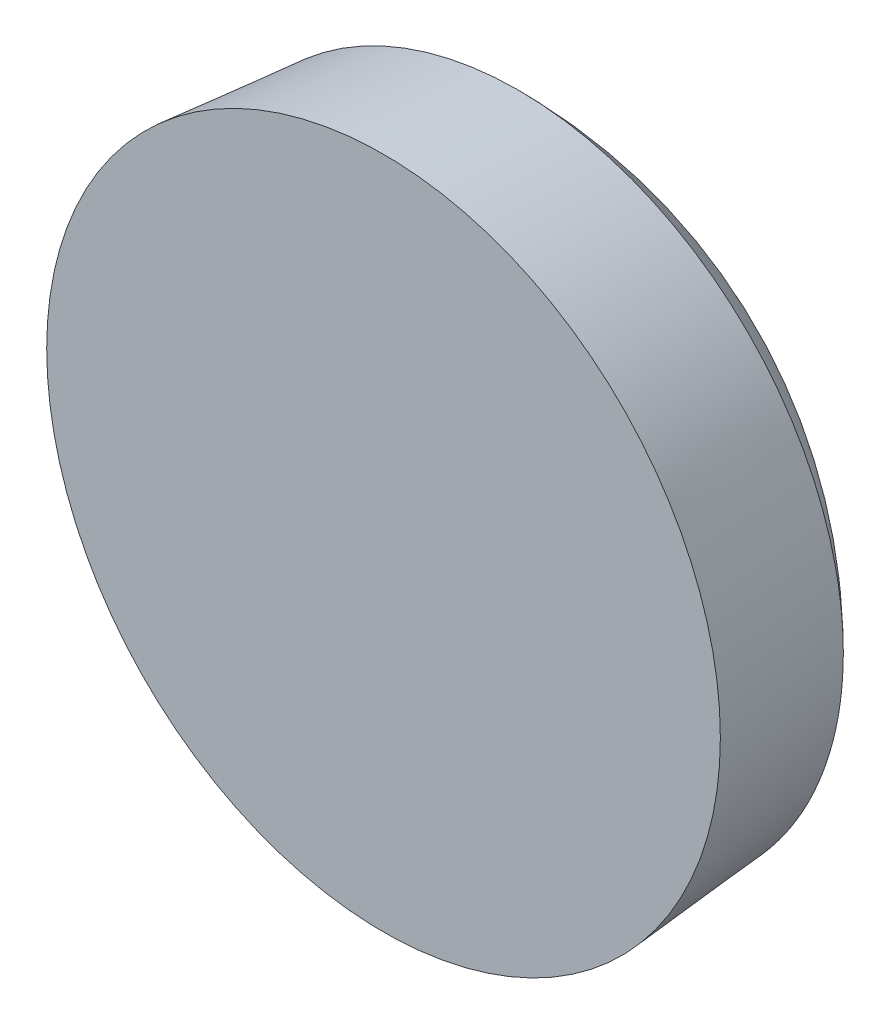
ISO-10303-21;
HEADER;
FILE_DESCRIPTION(('STEP AP214'),'2;1');
FILE_NAME('part.step','',(''),(''),'','','');
FILE_SCHEMA(('AUTOMOTIVE_DESIGN { 1 0 10303 214 1 1 1 1 }'));
ENDSEC;
DATA;
#1=APPLICATION_CONTEXT('core data for automotive mechanical design processes');
#2=APPLICATION_PROTOCOL_DEFINITION('international standard','automotive_design',2000,#1);
#3=PRODUCT_CONTEXT('',#1,'mechanical');
#4=PRODUCT('Part','Part','',(#3));
#5=PRODUCT_RELATED_PRODUCT_CATEGORY('part','',(#4));
#6=PRODUCT_DEFINITION_FORMATION('','',#4);
#7=PRODUCT_DEFINITION_CONTEXT('part definition',#1,'design');
#8=PRODUCT_DEFINITION('design','',#6,#7);
#9=PRODUCT_DEFINITION_SHAPE('','',#8);
#10=(LENGTH_UNIT() NAMED_UNIT(*) SI_UNIT(.MILLI.,.METRE.));
#11=(NAMED_UNIT(*) PLANE_ANGLE_UNIT() SI_UNIT($,.RADIAN.));
#12=(NAMED_UNIT(*) SI_UNIT($,.STERADIAN.) SOLID_ANGLE_UNIT());
#13=UNCERTAINTY_MEASURE_WITH_UNIT(LENGTH_MEASURE(1.E-05),#10,'distance_accuracy_value','');
#14=(GEOMETRIC_REPRESENTATION_CONTEXT(3) GLOBAL_UNCERTAINTY_ASSIGNED_CONTEXT((#13)) GLOBAL_UNIT_ASSIGNED_CONTEXT((#10,
#11,#12)) REPRESENTATION_CONTEXT('',''));
#15=CARTESIAN_POINT('',(0.,0.,0.));
#16=DIRECTION('',(0.,0.,1.));
#17=DIRECTION('',(1.,0.,0.));
#18=AXIS2_PLACEMENT_3D('',#15,#16,#17);
#19=CARTESIAN_POINT('',(6.90000000000015,4.50499199787339,-21.6));
#20=DIRECTION('',(0.,0.,-1.));
#21=DIRECTION('',(0.,1.,0.));
#22=AXIS2_PLACEMENT_3D('',#19,#20,#21);
#23=PLANE('',#22);
#24=DIRECTION('',(0.747876143588401,-0.66383828893138,0.));
#25=VECTOR('',#24,1.);
#26=CARTESIAN_POINT('',(7.0194908920078,4.6396097037193,-21.6));
#27=LINE('',#26,#25);
#28=CARTESIAN_POINT('',(6.88487318616189,4.75910059572695,-21.6));
#29=VERTEX_POINT('',#28);
#30=CARTESIAN_POINT('',(6.30900855559882,5.27025607820411,-21.6));
#31=VERTEX_POINT('',#30);
#32=EDGE_CURVE('E84',#29,#31,#27,.F.);
#33=ORIENTED_EDGE('',*,*,#32,.F.);
#34=DIRECTION('',(0.66383828893138,0.747876143588401,0.));
#35=VECTOR('',#34,1.);
#36=CARTESIAN_POINT('',(6.76538229415424,4.62448288988104,-21.6));
#37=LINE('',#36,#35);
#38=CARTESIAN_POINT('',(7.39602866863905,5.33496522629002,-21.6));
#39=VERTEX_POINT('',#38);
#40=EDGE_CURVE('E89',#39,#29,#37,.F.);
#41=ORIENTED_EDGE('',*,*,#40,.F.);
#42=DIRECTION('',(0.747876143588401,-0.66383828893138,0.));
#43=VECTOR('',#42,1.);
#44=CARTESIAN_POINT('',(7.53064637448496,5.21547433428237,-21.6));
#45=LINE('',#44,#43);
#46=CARTESIAN_POINT('',(7.66526408033087,5.09598344227472,-21.6));
#47=VERTEX_POINT('',#46);
#48=EDGE_CURVE('E140',#47,#39,#45,.F.);
#49=ORIENTED_EDGE('',*,*,#48,.F.);
#50=DIRECTION('',(-0.66383828893138,-0.747876143588401,0.));
#51=VECTOR('',#50,1.);
#52=CARTESIAN_POINT('',(7.03461770584606,4.38550110586574,-21.6));
#53=LINE('',#52,#51);
#54=CARTESIAN_POINT('',(7.15410859785371,4.52011881171165,-21.6));
#55=VERTEX_POINT('',#54);
#56=EDGE_CURVE('E151',#55,#47,#53,.F.);
#57=ORIENTED_EDGE('',*,*,#56,.F.);
#58=DIRECTION('',(0.747876143588401,-0.66383828893138,0.));
#59=VECTOR('',#58,1.);
#60=CARTESIAN_POINT('',(7.0194908920078,4.6396097037193,-21.6));
#61=LINE('',#60,#59);
#62=CARTESIAN_POINT('',(7.72997322841678,4.0089633292345,-21.6));
#63=VERTEX_POINT('',#62);
#64=EDGE_CURVE('E154',#63,#55,#61,.F.);
#65=ORIENTED_EDGE('',*,*,#64,.F.);
#66=DIRECTION('',(-0.66383828893138,-0.747876143588401,0.));
#67=VECTOR('',#66,1.);
#68=CARTESIAN_POINT('',(7.61048233640913,3.87434562338858,-21.6));
#69=LINE('',#68,#67);
#70=CARTESIAN_POINT('',(7.49099144440148,3.73972791754266,-21.6));
#71=VERTEX_POINT('',#70);
#72=EDGE_CURVE('E162',#71,#63,#69,.F.);
#73=ORIENTED_EDGE('',*,*,#72,.F.);
#74=DIRECTION('',(-0.747876143588401,0.66383828893138,0.));
#75=VECTOR('',#74,1.);
#76=CARTESIAN_POINT('',(6.7805091079925,4.37037429202747,-21.6));
#77=LINE('',#76,#75);
#78=CARTESIAN_POINT('',(6.91512681383842,4.25088340001982,-21.6));
#79=VERTEX_POINT('',#78);
#80=EDGE_CURVE('E167',#79,#71,#77,.F.);
#81=ORIENTED_EDGE('',*,*,#80,.F.);
#82=DIRECTION('',(-0.66383828893138,-0.747876143588401,0.));
#83=VECTOR('',#82,1.);
#84=CARTESIAN_POINT('',(7.03461770584606,4.38550110586574,-21.6));
#85=LINE('',#84,#83);
#86=CARTESIAN_POINT('',(6.40397133136125,3.67501876945676,-21.6));
#87=VERTEX_POINT('',#86);
#88=EDGE_CURVE('E172',#87,#79,#85,.F.);
#89=ORIENTED_EDGE('',*,*,#88,.F.);
#90=DIRECTION('',(0.747876143588401,-0.66383828893138,0.));
#91=VECTOR('',#90,1.);
#92=CARTESIAN_POINT('',(6.26935362551534,3.79450966146441,-21.6));
#93=LINE('',#92,#91);
#94=CARTESIAN_POINT('',(6.13473591966943,3.91400055347206,-21.6));
#95=VERTEX_POINT('',#94);
#96=EDGE_CURVE('E178',#87,#95,#93,.F.);
#97=ORIENTED_EDGE('',*,*,#96,.T.);
#98=DIRECTION('',(0.66383828893138,0.747876143588401,0.));
#99=VECTOR('',#98,1.);
#100=CARTESIAN_POINT('',(6.76538229415424,4.62448288988104,-21.6));
#101=LINE('',#100,#99);
#102=CARTESIAN_POINT('',(6.64589140214659,4.48986518403512,-21.6));
#103=VERTEX_POINT('',#102);
#104=EDGE_CURVE('E183',#103,#95,#101,.F.);
#105=ORIENTED_EDGE('',*,*,#104,.F.);
#106=DIRECTION('',(-0.747876143588401,0.66383828893138,0.));
#107=VECTOR('',#106,1.);
#108=CARTESIAN_POINT('',(6.7805091079925,4.37037429202747,-21.6));
#109=LINE('',#108,#107);
#110=CARTESIAN_POINT('',(6.07002677158352,5.00102066651228,-21.6));
#111=VERTEX_POINT('',#110);
#112=EDGE_CURVE('E119',#111,#103,#109,.F.);
#113=ORIENTED_EDGE('',*,*,#112,.F.);
#114=DIRECTION('',(-0.66383828893138,-0.747876143588401,0.));
#115=VECTOR('',#114,1.);
#116=CARTESIAN_POINT('',(6.18951766359117,5.1356383723582,-21.6));
#117=LINE('',#116,#115);
#118=EDGE_CURVE('E117',#111,#31,#117,.F.);
#119=ORIENTED_EDGE('',*,*,#118,.T.);
#120=EDGE_LOOP('',(#33,#41,#49,#57,#65,#73,#81,#89,#97,#105,#113,#119));
#121=FACE_BOUND('',#120,.T.);
#122=ADVANCED_FACE('F17',(#121),#23,.T.);
#123=CARTESIAN_POINT('',(7.0194908920078,4.6396097037193,-22.2));
#124=DIRECTION('',(-0.66383828893138,-0.747876143588401,0.));
#125=DIRECTION('',(0.747876143588401,-0.66383828893138,0.));
#126=AXIS2_PLACEMENT_3D('',#123,#124,#125);
#127=PLANE('',#126);
#128=DIRECTION('',(0.,0.,1.));
#129=VECTOR('',#128,1.);
#130=CARTESIAN_POINT('',(6.88487318616189,4.75910059572695,-22.2));
#131=LINE('',#130,#129);
#132=CARTESIAN_POINT('',(6.88487318616188,4.75910059572695,-22.788097569794));
#133=VERTEX_POINT('',#132);
#134=EDGE_CURVE('E127',#29,#133,#131,.F.);
#135=ORIENTED_EDGE('',*,*,#134,.F.);
#136=ORIENTED_EDGE('',*,*,#32,.T.);
#137=DIRECTION('',(0.,0.,1.));
#138=VECTOR('',#137,1.);
#139=CARTESIAN_POINT('',(6.30900855559882,5.27025607820411,-22.2));
#140=LINE('',#139,#138);
#141=CARTESIAN_POINT('',(6.30900855559882,5.27025607820411,-22.6229045231911));
#142=VERTEX_POINT('',#141);
#143=EDGE_CURVE('E123',#31,#142,#140,.F.);
#144=ORIENTED_EDGE('',*,*,#143,.T.);
#145=CARTESIAN_POINT('',(6.88487318616188,4.75910059572695,-22.788097569794));
#146=CARTESIAN_POINT('',(6.86018725238199,4.78101260372668,-22.7859104299673));
#147=CARTESIAN_POINT('',(6.83553118762501,4.80289809904617,-22.7831210421487));
#148=CARTESIAN_POINT('',(6.78640820570417,4.84650119635726,-22.7763560552392));
#149=CARTESIAN_POINT('',(6.76194092600565,4.868219120146,-22.7723851623111));
#150=CARTESIAN_POINT('',(6.71319426733734,4.91148818115152,-22.7632701136372));
#151=CARTESIAN_POINT('',(6.68891456403111,4.93303960625947,-22.7581290588921));
#152=CARTESIAN_POINT('',(6.64054218782471,4.97597644242906,-22.7466823115268));
#153=CARTESIAN_POINT('',(6.61644931068595,4.99736203477927,-22.7403781619621));
#154=CARTESIAN_POINT('',(6.56844981562365,5.03996788996653,-22.7266089835755));
#155=CARTESIAN_POINT('',(6.54454319770011,5.06118815280357,-22.7191439547536));
#156=CARTESIAN_POINT('',(6.4969160965814,5.10346345946291,-22.703052205587));
#157=CARTESIAN_POINT('',(6.47319590048996,5.12451824844295,-22.6944239659575));
#158=CARTESIAN_POINT('',(6.42594275839351,5.16646161736154,-22.6760004253173));
#159=CARTESIAN_POINT('',(6.40241046789994,5.1873496154476,-22.666202118307));
#160=CARTESIAN_POINT('',(6.35553505693748,5.22895769838091,-22.6454289197685));
#161=CARTESIAN_POINT('',(6.33219304956501,5.24967679520893,-22.6344495373844));
#162=CARTESIAN_POINT('',(6.30900855559883,5.2702560782041,-22.622904523191));
#163=B_SPLINE_CURVE_WITH_KNOTS('',3,(#145,#146,#147,#148,#149,#150,#151,#152,#153,#154,#155,
#156,#157,#158,#159,#160,#161,#162),.UNSPECIFIED.,.F.,.F.,(4,2,2,2,2,2,2,2,4),(0.,
0.0992357442434143,0.198081387639265,0.29666807248049,0.395124892694086,0.493581712907683,
0.592168397748907,0.691014041144757,0.790249785388171),.UNSPECIFIED.);
#164=EDGE_CURVE('E20',#133,#142,#163,.T.);
#165=ORIENTED_EDGE('',*,*,#164,.F.);
#166=EDGE_LOOP('',(#135,#136,#144,#165));
#167=FACE_BOUND('',#166,.T.);
#168=ADVANCED_FACE('F125',(#167),#127,.T.);
#169=CARTESIAN_POINT('',(6.18951766359117,5.1356383723582,-22.2));
#170=DIRECTION('',(-0.747876143588401,0.66383828893138,0.));
#171=DIRECTION('',(-0.66383828893138,-0.747876143588401,0.));
#172=AXIS2_PLACEMENT_3D('',#169,#170,#171);
#173=PLANE('',#172);
#174=ORIENTED_EDGE('',*,*,#118,.F.);
#175=DIRECTION('',(0.,0.,1.));
#176=VECTOR('',#175,1.);
#177=CARTESIAN_POINT('',(6.07002677158352,5.00102066651228,-22.2));
#178=LINE('',#177,#176);
#179=CARTESIAN_POINT('',(6.07002677158353,5.00102066651227,-22.6229045231911));
#180=VERTEX_POINT('',#179);
#181=EDGE_CURVE('E132',#180,#111,#178,.T.);
#182=ORIENTED_EDGE('',*,*,#181,.F.);
#183=CARTESIAN_POINT('',(6.30900855559881,5.27025607820411,-22.622904523191));
#184=CARTESIAN_POINT('',(6.26917825826292,5.22538350958884,-22.6271329188894));
#185=CARTESIAN_POINT('',(6.22934796092705,5.18051094097354,-22.6292471167385));
#186=CARTESIAN_POINT('',(6.14968736625534,5.09076580374292,-22.6292471167385));
#187=CARTESIAN_POINT('',(6.10985706891951,5.04589323512759,-22.6271329188894));
#188=CARTESIAN_POINT('',(6.0700267715837,5.00102066651224,-22.6229045231911));
#189=B_SPLINE_CURVE_WITH_KNOTS('',3,(#183,#184,#185,#186,#187,#188),.UNSPECIFIED.,.F.,.F.,(4,2,
4),(0.,0.180111711148645,0.36022342229729),.UNSPECIFIED.);
#190=EDGE_CURVE('E131',#142,#180,#189,.T.);
#191=ORIENTED_EDGE('',*,*,#190,.F.);
#192=ORIENTED_EDGE('',*,*,#143,.F.);
#193=EDGE_LOOP('',(#174,#182,#191,#192));
#194=FACE_BOUND('',#193,.T.);
#195=ADVANCED_FACE('F129',(#194),#173,.F.);
#196=CARTESIAN_POINT('',(6.7805091079925,4.37037429202747,-22.2));
#197=DIRECTION('',(0.66383828893138,0.747876143588401,0.));
#198=DIRECTION('',(-0.747876143588401,0.66383828893138,0.));
#199=AXIS2_PLACEMENT_3D('',#196,#197,#198);
#200=PLANE('',#199);
#201=DIRECTION('',(0.,0.,1.));
#202=VECTOR('',#201,1.);
#203=CARTESIAN_POINT('',(6.64589140214659,4.48986518403512,-22.2));
#204=LINE('',#203,#202);
#205=CARTESIAN_POINT('',(6.64589140214659,4.48986518403512,-22.788097569794));
#206=VERTEX_POINT('',#205);
#207=EDGE_CURVE('E180',#206,#103,#204,.T.);
#208=ORIENTED_EDGE('',*,*,#207,.F.);
#209=CARTESIAN_POINT('',(6.07002677158354,5.00102066651226,-22.622904523191));
#210=CARTESIAN_POINT('',(6.09321126554971,4.98044138351709,-22.6344495373844));
#211=CARTESIAN_POINT('',(6.11655327292218,4.95972228668908,-22.6454289197685));
#212=CARTESIAN_POINT('',(6.16342868388464,4.91811420375577,-22.666202118307));
#213=CARTESIAN_POINT('',(6.18696097437821,4.8972262056697,-22.6760004253173));
#214=CARTESIAN_POINT('',(6.23421411647466,4.85528283675112,-22.6944239659575));
#215=CARTESIAN_POINT('',(6.2579343125661,4.83422804777108,-22.703052205587));
#216=CARTESIAN_POINT('',(6.30556141368481,4.79195274111174,-22.7191439547536));
#217=CARTESIAN_POINT('',(6.32946803160835,4.77073247827469,-22.7266089835755));
#218=CARTESIAN_POINT('',(6.37746752667065,4.72812662308744,-22.7403781619621));
#219=CARTESIAN_POINT('',(6.40156040380941,4.70674103073723,-22.7466823115268));
#220=CARTESIAN_POINT('',(6.44993278001582,4.66380419456763,-22.7581290588921));
#221=CARTESIAN_POINT('',(6.47421248332204,4.64225276945969,-22.7632701136372));
#222=CARTESIAN_POINT('',(6.52295914199035,4.59898370845417,-22.7723851623111));
#223=CARTESIAN_POINT('',(6.54742642168887,4.57726578466543,-22.7763560552392));
#224=CARTESIAN_POINT('',(6.59654940360971,4.53366268735434,-22.7831210421487));
#225=CARTESIAN_POINT('',(6.62120546836669,4.51177719203485,-22.7859104299673));
#226=CARTESIAN_POINT('',(6.64589140214659,4.48986518403512,-22.788097569794));
#227=B_SPLINE_CURVE_WITH_KNOTS('',3,(#209,#210,#211,#212,#213,#214,#215,#216,#217,#218,#219,
#220,#221,#222,#223,#224,#225,#226),.UNSPECIFIED.,.F.,.F.,(4,2,2,2,2,2,2,2,4),(0.,
0.0992357442434151,0.198081387639264,0.296668072480488,0.395124892694086,0.493581712907683,
0.592168397748907,0.691014041144756,0.790249785388172),.UNSPECIFIED.);
#228=EDGE_CURVE('E296',#180,#206,#227,.T.);
#229=ORIENTED_EDGE('',*,*,#228,.F.);
#230=ORIENTED_EDGE('',*,*,#181,.T.);
#231=ORIENTED_EDGE('',*,*,#112,.T.);
#232=EDGE_LOOP('',(#208,#229,#230,#231));
#233=FACE_BOUND('',#232,.T.);
#234=ADVANCED_FACE('F305',(#233),#200,.T.);
#235=CARTESIAN_POINT('',(6.76538229415424,4.62448288988104,-22.2));
#236=DIRECTION('',(0.747876143588401,-0.66383828893138,0.));
#237=DIRECTION('',(0.66383828893138,0.747876143588401,0.));
#238=AXIS2_PLACEMENT_3D('',#235,#236,#237);
#239=PLANE('',#238);
#240=CARTESIAN_POINT('',(6.64589140214659,4.48986518403512,-22.788097569794));
#241=CARTESIAN_POINT('',(6.62397939414685,4.46517925025523,-22.7859104299673));
#242=CARTESIAN_POINT('',(6.60209389882737,4.44052318549824,-22.7831210421487));
#243=CARTESIAN_POINT('',(6.55849080151627,4.39140020357741,-22.7763560552392));
#244=CARTESIAN_POINT('',(6.53677287772753,4.36693292387889,-22.7723851623111));
#245=CARTESIAN_POINT('',(6.49350381672202,4.31818626521058,-22.7632701136372));
#246=CARTESIAN_POINT('',(6.47195239161407,4.29390656190435,-22.7581290588921));
#247=CARTESIAN_POINT('',(6.42901555544448,4.24553418569795,-22.7466823115268));
#248=CARTESIAN_POINT('',(6.40762996309427,4.22144130855919,-22.740378161962));
#249=CARTESIAN_POINT('',(6.36502410790701,4.17344181349689,-22.7266089835755));
#250=CARTESIAN_POINT('',(6.34380384506997,4.14953519557335,-22.7191439547536));
#251=CARTESIAN_POINT('',(6.30152853841063,4.10190809445464,-22.703052205587));
#252=CARTESIAN_POINT('',(6.28047374943059,4.07818789836319,-22.6944239659575));
#253=CARTESIAN_POINT('',(6.238530380512,4.03093475626675,-22.6760004253173));
#254=CARTESIAN_POINT('',(6.21764238242594,4.00740246577318,-22.666202118307));
#255=CARTESIAN_POINT('',(6.17603429949263,3.96052705481073,-22.6454289197685));
#256=CARTESIAN_POINT('',(6.15531520266461,3.93718504743825,-22.6344495373844));
#257=CARTESIAN_POINT('',(6.13473591966944,3.91400055347208,-22.622904523191));
#258=B_SPLINE_CURVE_WITH_KNOTS('',3,(#240,#241,#242,#243,#244,#245,#246,#247,#248,#249,#250,
#251,#252,#253,#254,#255,#256,#257),.UNSPECIFIED.,.F.,.F.,(4,2,2,2,2,2,2,2,4),(0.,
0.0992357442434152,0.198081387639265,0.296668072480487,0.395124892694085,0.493581712907683,
0.592168397748906,0.691014041144754,0.790249785388169),.UNSPECIFIED.);
#259=CARTESIAN_POINT('',(6.13473591966943,3.91400055347206,-22.6229045231911));
#260=VERTEX_POINT('',#259);
#261=EDGE_CURVE('E289',#206,#260,#258,.T.);
#262=ORIENTED_EDGE('',*,*,#261,.F.);
#263=ORIENTED_EDGE('',*,*,#207,.T.);
#264=ORIENTED_EDGE('',*,*,#104,.T.);
#265=DIRECTION('',(0.,0.,1.));
#266=VECTOR('',#265,1.);
#267=CARTESIAN_POINT('',(6.13473591966943,3.91400055347206,-22.2));
#268=LINE('',#267,#266);
#269=EDGE_CURVE('E175',#95,#260,#268,.F.);
#270=ORIENTED_EDGE('',*,*,#269,.T.);
#271=EDGE_LOOP('',(#262,#263,#264,#270));
#272=FACE_BOUND('',#271,.T.);
#273=ADVANCED_FACE('F302',(#272),#239,.T.);
#274=CARTESIAN_POINT('',(6.26935362551534,3.79450966146441,-22.2));
#275=DIRECTION('',(-0.66383828893138,-0.747876143588401,0.));
#276=DIRECTION('',(0.747876143588401,-0.66383828893138,0.));
#277=AXIS2_PLACEMENT_3D('',#274,#275,#276);
#278=PLANE('',#277);
#279=ORIENTED_EDGE('',*,*,#96,.F.);
#280=DIRECTION('',(0.,0.,1.));
#281=VECTOR('',#280,1.);
#282=CARTESIAN_POINT('',(6.40397133136125,3.67501876945676,-22.2));
#283=LINE('',#282,#281);
#284=CARTESIAN_POINT('',(6.40397133136126,3.67501876945677,-22.6229045231911));
#285=VERTEX_POINT('',#284);
#286=EDGE_CURVE('E174',#285,#87,#283,.T.);
#287=ORIENTED_EDGE('',*,*,#286,.F.);
#288=CARTESIAN_POINT('',(6.13473591966943,3.91400055347205,-22.622904523191));
#289=CARTESIAN_POINT('',(6.17960848828473,3.87417025613617,-22.6271329188894));
#290=CARTESIAN_POINT('',(6.22448105690004,3.83433995880029,-22.6292471167385));
#291=CARTESIAN_POINT('',(6.31422619413064,3.75467936412853,-22.6292471167385));
#292=CARTESIAN_POINT('',(6.35909876274594,3.71484906679265,-22.6271329188894));
#293=CARTESIAN_POINT('',(6.40397133136125,3.67501876945677,-22.622904523191));
#294=B_SPLINE_CURVE_WITH_KNOTS('',3,(#288,#289,#290,#291,#292,#293),.UNSPECIFIED.,.F.,.F.,(4,2,
4),(0.,0.180111711148682,0.360223422297365),.UNSPECIFIED.);
#295=EDGE_CURVE('E282',#260,#285,#294,.T.);
#296=ORIENTED_EDGE('',*,*,#295,.F.);
#297=ORIENTED_EDGE('',*,*,#269,.F.);
#298=EDGE_LOOP('',(#279,#287,#296,#297));
#299=FACE_BOUND('',#298,.T.);
#300=ADVANCED_FACE('F271',(#299),#278,.F.);
#301=CARTESIAN_POINT('',(7.03461770584606,4.38550110586574,-22.2));
#302=DIRECTION('',(-0.747876143588401,0.66383828893138,0.));
#303=DIRECTION('',(-0.66383828893138,-0.747876143588401,0.));
#304=AXIS2_PLACEMENT_3D('',#301,#302,#303);
#305=PLANE('',#304);
#306=CARTESIAN_POINT('',(6.40397133136126,3.67501876945678,-22.622904523191));
#307=CARTESIAN_POINT('',(6.42455061435644,3.69820326342295,-22.6344495373844));
#308=CARTESIAN_POINT('',(6.44526971118445,3.72154527079543,-22.6454289197685));
#309=CARTESIAN_POINT('',(6.48687779411776,3.76842068175788,-22.666202118307));
#310=CARTESIAN_POINT('',(6.50776579220383,3.79195297225145,-22.6760004253173));
#311=CARTESIAN_POINT('',(6.54970916112241,3.8392061143479,-22.6944239659575));
#312=CARTESIAN_POINT('',(6.57076395010245,3.86292631043934,-22.703052205587));
#313=CARTESIAN_POINT('',(6.61303925676179,3.91055341155805,-22.7191439547536));
#314=CARTESIAN_POINT('',(6.63425951959884,3.93446002948159,-22.7266089835755));
#315=CARTESIAN_POINT('',(6.67686537478609,3.98245952454389,-22.7403781619621));
#316=CARTESIAN_POINT('',(6.6982509671363,4.00655240168265,-22.7466823115268));
#317=CARTESIAN_POINT('',(6.74118780330589,4.05492477788906,-22.7581290588921));
#318=CARTESIAN_POINT('',(6.76273922841384,4.07920448119528,-22.7632701136372));
#319=CARTESIAN_POINT('',(6.80600828941936,4.1279511398636,-22.7723851623111));
#320=CARTESIAN_POINT('',(6.8277262132081,4.15241841956212,-22.7763560552392));
#321=CARTESIAN_POINT('',(6.87132931051919,4.20154140148295,-22.7831210421487));
#322=CARTESIAN_POINT('',(6.89321480583868,4.22619746623993,-22.7859104299673));
#323=CARTESIAN_POINT('',(6.91512681383841,4.25088340001983,-22.788097569794));
#324=B_SPLINE_CURVE_WITH_KNOTS('',3,(#306,#307,#308,#309,#310,#311,#312,#313,#314,#315,#316,
#317,#318,#319,#320,#321,#322,#323),.UNSPECIFIED.,.F.,.F.,(4,2,2,2,2,2,2,2,4),(0.,
0.0992357442434159,0.198081387639264,0.296668072480487,0.395124892694085,0.493581712907682,
0.592168397748907,0.691014041144756,0.79024978538817),.UNSPECIFIED.);
#325=CARTESIAN_POINT('',(6.91512681383842,4.25088340001982,-22.788097569794));
#326=VERTEX_POINT('',#325);
#327=EDGE_CURVE('E275',#285,#326,#324,.T.);
#328=ORIENTED_EDGE('',*,*,#327,.F.);
#329=ORIENTED_EDGE('',*,*,#286,.T.);
#330=ORIENTED_EDGE('',*,*,#88,.T.);
#331=DIRECTION('',(0.,0.,1.));
#332=VECTOR('',#331,1.);
#333=CARTESIAN_POINT('',(6.91512681383842,4.25088340001982,-22.2));
#334=LINE('',#333,#332);
#335=EDGE_CURVE('E169',#326,#79,#334,.T.);
#336=ORIENTED_EDGE('',*,*,#335,.F.);
#337=EDGE_LOOP('',(#328,#329,#330,#336));
#338=FACE_BOUND('',#337,.T.);
#339=ADVANCED_FACE('F266',(#338),#305,.T.);
#340=CARTESIAN_POINT('',(6.7805091079925,4.37037429202747,-22.2));
#341=DIRECTION('',(0.66383828893138,0.747876143588401,0.));
#342=DIRECTION('',(-0.747876143588401,0.66383828893138,0.));
#343=AXIS2_PLACEMENT_3D('',#340,#341,#342);
#344=PLANE('',#343);
#345=ORIENTED_EDGE('',*,*,#335,.T.);
#346=ORIENTED_EDGE('',*,*,#80,.T.);
#347=DIRECTION('',(0.,0.,1.));
#348=VECTOR('',#347,1.);
#349=CARTESIAN_POINT('',(7.49099144440148,3.73972791754266,-22.2));
#350=LINE('',#349,#348);
#351=CARTESIAN_POINT('',(7.49099144440148,3.73972791754266,-22.6229045231911));
#352=VERTEX_POINT('',#351);
#353=EDGE_CURVE('E164',#352,#71,#350,.T.);
#354=ORIENTED_EDGE('',*,*,#353,.F.);
#355=CARTESIAN_POINT('',(6.91512681383841,4.25088340001982,-22.788097569794));
#356=CARTESIAN_POINT('',(6.93981274761831,4.22897139202008,-22.7859104299673));
#357=CARTESIAN_POINT('',(6.96446881237529,4.2070858967006,-22.7831210421487));
#358=CARTESIAN_POINT('',(7.01359179429612,4.1634827993895,-22.7763560552392));
#359=CARTESIAN_POINT('',(7.03805907399464,4.14176487560076,-22.7723851623111));
#360=CARTESIAN_POINT('',(7.08680573266296,4.09849581459525,-22.7632701136372));
#361=CARTESIAN_POINT('',(7.11108543596918,4.0769443894873,-22.7581290588921));
#362=CARTESIAN_POINT('',(7.15945781217559,4.03400755331771,-22.7466823115268));
#363=CARTESIAN_POINT('',(7.18355068931435,4.0126219609675,-22.740378161962));
#364=CARTESIAN_POINT('',(7.23155018437665,3.97001610578024,-22.7266089835755));
#365=CARTESIAN_POINT('',(7.25545680230019,3.9487958429432,-22.7191439547536));
#366=CARTESIAN_POINT('',(7.3030839034189,3.90652053628386,-22.703052205587));
#367=CARTESIAN_POINT('',(7.32680409951034,3.88546574730382,-22.6944239659575));
#368=CARTESIAN_POINT('',(7.37405724160679,3.84352237838523,-22.6760004253173));
#369=CARTESIAN_POINT('',(7.39758953210036,3.82263438029917,-22.666202118307));
#370=CARTESIAN_POINT('',(7.44446494306281,3.78102629736586,-22.6454289197685));
#371=CARTESIAN_POINT('',(7.46780695043529,3.76030720053785,-22.6344495373844));
#372=CARTESIAN_POINT('',(7.49099144440146,3.73972791754268,-22.622904523191));
#373=B_SPLINE_CURVE_WITH_KNOTS('',3,(#355,#356,#357,#358,#359,#360,#361,#362,#363,#364,#365,
#366,#367,#368,#369,#370,#371,#372),.UNSPECIFIED.,.F.,.F.,(4,2,2,2,2,2,2,2,4),(0.,
0.0992357442434133,0.198081387639263,0.296668072480487,0.395124892694084,0.493581712907682,
0.592168397748905,0.691014041144754,0.790249785388168),.UNSPECIFIED.);
#374=EDGE_CURVE('E251',#326,#352,#373,.T.);
#375=ORIENTED_EDGE('',*,*,#374,.F.);
#376=EDGE_LOOP('',(#345,#346,#354,#375));
#377=FACE_BOUND('',#376,.T.);
#378=ADVANCED_FACE('F261',(#377),#344,.T.);
#379=CARTESIAN_POINT('',(7.61048233640913,3.87434562338858,-22.2));
#380=DIRECTION('',(-0.747876143588401,0.66383828893138,0.));
#381=DIRECTION('',(-0.66383828893138,-0.747876143588401,0.));
#382=AXIS2_PLACEMENT_3D('',#379,#380,#381);
#383=PLANE('',#382);
#384=ORIENTED_EDGE('',*,*,#353,.T.);
#385=ORIENTED_EDGE('',*,*,#72,.T.);
#386=DIRECTION('',(0.,0.,1.));
#387=VECTOR('',#386,1.);
#388=CARTESIAN_POINT('',(7.72997322841677,4.0089633292345,-22.2));
#389=LINE('',#388,#387);
#390=CARTESIAN_POINT('',(7.72997322841677,4.0089633292345,-22.6229045231911));
#391=VERTEX_POINT('',#390);
#392=EDGE_CURVE('E159',#391,#63,#389,.T.);
#393=ORIENTED_EDGE('',*,*,#392,.F.);
#394=CARTESIAN_POINT('',(7.49099144440148,3.73972791754267,-22.622904523191));
#395=CARTESIAN_POINT('',(7.53082174173736,3.78460048615797,-22.6271329188894));
#396=CARTESIAN_POINT('',(7.57065203907325,3.82947305477328,-22.6292471167385));
#397=CARTESIAN_POINT('',(7.65031263374501,3.91921819200389,-22.6292471167385));
#398=CARTESIAN_POINT('',(7.6901429310809,3.96409076061919,-22.6271329188894));
#399=CARTESIAN_POINT('',(7.72997322841678,4.0089633292345,-22.622904523191));
#400=B_SPLINE_CURVE_WITH_KNOTS('',3,(#394,#395,#396,#397,#398,#399),.UNSPECIFIED.,.F.,.F.,(4,2,
4),(0.,0.180111711148692,0.360223422297383),.UNSPECIFIED.);
#401=EDGE_CURVE('E244',#352,#391,#400,.T.);
#402=ORIENTED_EDGE('',*,*,#401,.F.);
#403=EDGE_LOOP('',(#384,#385,#393,#402));
#404=FACE_BOUND('',#403,.T.);
#405=ADVANCED_FACE('F258',(#404),#383,.T.);
#406=CARTESIAN_POINT('',(7.0194908920078,4.6396097037193,-22.2));
#407=DIRECTION('',(-0.66383828893138,-0.747876143588401,0.));
#408=DIRECTION('',(0.747876143588401,-0.66383828893138,0.));
#409=AXIS2_PLACEMENT_3D('',#406,#407,#408);
#410=PLANE('',#409);
#411=DIRECTION('',(0.,0.,1.));
#412=VECTOR('',#411,1.);
#413=CARTESIAN_POINT('',(7.15410859785371,4.52011881171165,-22.2));
#414=LINE('',#413,#412);
#415=CARTESIAN_POINT('',(7.15410859785371,4.52011881171165,-22.788097569794));
#416=VERTEX_POINT('',#415);
#417=EDGE_CURVE('E143',#416,#55,#414,.T.);
#418=ORIENTED_EDGE('',*,*,#417,.F.);
#419=CARTESIAN_POINT('',(7.72997322841676,4.00896332923451,-22.622904523191));
#420=CARTESIAN_POINT('',(7.70678873445059,4.02954261222968,-22.6344495373844));
#421=CARTESIAN_POINT('',(7.68344672707811,4.05026170905769,-22.6454289197685));
#422=CARTESIAN_POINT('',(7.63657131611566,4.091869791991,-22.666202118307));
#423=CARTESIAN_POINT('',(7.61303902562208,4.11275779007707,-22.6760004253173));
#424=CARTESIAN_POINT('',(7.56578588352564,4.15470115899565,-22.6944239659575));
#425=CARTESIAN_POINT('',(7.54206568743419,4.17575594797569,-22.703052205587));
#426=CARTESIAN_POINT('',(7.49443858631549,4.21803125463503,-22.7191439547536));
#427=CARTESIAN_POINT('',(7.47053196839194,4.23925151747208,-22.7266089835755));
#428=CARTESIAN_POINT('',(7.42253247332964,4.28185737265933,-22.7403781619621));
#429=CARTESIAN_POINT('',(7.39843959619088,4.30324296500954,-22.7466823115268));
#430=CARTESIAN_POINT('',(7.35006721998448,4.34617980117914,-22.7581290588921));
#431=CARTESIAN_POINT('',(7.32578751667825,4.36773122628708,-22.7632701136372));
#432=CARTESIAN_POINT('',(7.27704085800994,4.4110002872926,-22.7723851623111));
#433=CARTESIAN_POINT('',(7.25257357831142,4.43271821108134,-22.7763560552392));
#434=CARTESIAN_POINT('',(7.20345059639059,4.47632130839244,-22.7831210421487));
#435=CARTESIAN_POINT('',(7.1787945316336,4.49820680371192,-22.7859104299673));
#436=CARTESIAN_POINT('',(7.15410859785371,4.52011881171165,-22.788097569794));
#437=B_SPLINE_CURVE_WITH_KNOTS('',3,(#419,#420,#421,#422,#423,#424,#425,#426,#427,#428,#429,
#430,#431,#432,#433,#434,#435,#436),.UNSPECIFIED.,.F.,.F.,(4,2,2,2,2,2,2,2,4),(0.,
0.0992357442434146,0.198081387639264,0.296668072480486,0.395124892694085,0.493581712907682,
0.592168397748908,0.691014041144756,0.790249785388171),.UNSPECIFIED.);
#438=EDGE_CURVE('E237',#391,#416,#437,.T.);
#439=ORIENTED_EDGE('',*,*,#438,.F.);
#440=ORIENTED_EDGE('',*,*,#392,.T.);
#441=ORIENTED_EDGE('',*,*,#64,.T.);
#442=EDGE_LOOP('',(#418,#439,#440,#441));
#443=FACE_BOUND('',#442,.T.);
#444=ADVANCED_FACE('F226',(#443),#410,.T.);
#445=CARTESIAN_POINT('',(7.03461770584606,4.38550110586574,-22.2));
#446=DIRECTION('',(-0.747876143588401,0.66383828893138,0.));
#447=DIRECTION('',(-0.66383828893138,-0.747876143588401,0.));
#448=AXIS2_PLACEMENT_3D('',#445,#446,#447);
#449=PLANE('',#448);
#450=CARTESIAN_POINT('',(7.15410859785371,4.52011881171165,-22.788097569794));
#451=CARTESIAN_POINT('',(7.17602060585344,4.54480474549155,-22.7859104299673));
#452=CARTESIAN_POINT('',(7.19790610117292,4.56946081024853,-22.7831210421487));
#453=CARTESIAN_POINT('',(7.24150919848402,4.61858379216936,-22.7763560552392));
#454=CARTESIAN_POINT('',(7.26322712227276,4.64305107186788,-22.7723851623111));
#455=CARTESIAN_POINT('',(7.30649618327828,4.6917977305362,-22.7632701136372));
#456=CARTESIAN_POINT('',(7.32804760838622,4.71607743384242,-22.7581290588921));
#457=CARTESIAN_POINT('',(7.37098444455582,4.76444981004882,-22.7466823115268));
#458=CARTESIAN_POINT('',(7.39237003690603,4.78854268718758,-22.7403781619621));
#459=CARTESIAN_POINT('',(7.43497589209328,4.83654218224989,-22.7266089835755));
#460=CARTESIAN_POINT('',(7.45619615493033,4.86044880017343,-22.7191439547536));
#461=CARTESIAN_POINT('',(7.49847146158966,4.90807590129213,-22.703052205587));
#462=CARTESIAN_POINT('',(7.51952625056971,4.93179609738358,-22.6944239659575));
#463=CARTESIAN_POINT('',(7.56146961948829,4.97904923948003,-22.6760004253173));
#464=CARTESIAN_POINT('',(7.58235761757436,5.0025815299736,-22.666202118307));
#465=CARTESIAN_POINT('',(7.62396570050767,5.04945694093605,-22.6454289197685));
#466=CARTESIAN_POINT('',(7.64468479733568,5.07279894830853,-22.6344495373844));
#467=CARTESIAN_POINT('',(7.66526408033085,5.0959834422747,-22.622904523191));
#468=B_SPLINE_CURVE_WITH_KNOTS('',3,(#450,#451,#452,#453,#454,#455,#456,#457,#458,#459,#460,
#461,#462,#463,#464,#465,#466,#467),.UNSPECIFIED.,.F.,.F.,(4,2,2,2,2,2,2,2,4),(0.,
0.0992357442434143,0.198081387639264,0.296668072480488,0.395124892694085,0.493581712907682,
0.592168397748905,0.691014041144754,0.790249785388169),.UNSPECIFIED.);
#469=CARTESIAN_POINT('',(7.66526408033087,5.09598344227472,-22.6229045231911));
#470=VERTEX_POINT('',#469);
#471=EDGE_CURVE('E230',#416,#470,#468,.T.);
#472=ORIENTED_EDGE('',*,*,#471,.F.);
#473=ORIENTED_EDGE('',*,*,#417,.T.);
#474=ORIENTED_EDGE('',*,*,#56,.T.);
#475=DIRECTION('',(0.,0.,1.));
#476=VECTOR('',#475,1.);
#477=CARTESIAN_POINT('',(7.66526408033087,5.09598344227472,-22.2));
#478=LINE('',#477,#476);
#479=EDGE_CURVE('E142',#470,#47,#478,.T.);
#480=ORIENTED_EDGE('',*,*,#479,.F.);
#481=EDGE_LOOP('',(#472,#473,#474,#480));
#482=FACE_BOUND('',#481,.T.);
#483=ADVANCED_FACE('F222',(#482),#449,.T.);
#484=CARTESIAN_POINT('',(7.53064637448496,5.21547433428237,-22.2));
#485=DIRECTION('',(-0.66383828893138,-0.747876143588401,0.));
#486=DIRECTION('',(0.747876143588401,-0.66383828893138,0.));
#487=AXIS2_PLACEMENT_3D('',#484,#485,#486);
#488=PLANE('',#487);
#489=CARTESIAN_POINT('',(7.66526408033087,5.09598344227472,-22.622904523191));
#490=CARTESIAN_POINT('',(7.62039151171556,5.13581373961061,-22.6271329188894));
#491=CARTESIAN_POINT('',(7.57551894310026,5.17564403694649,-22.6292471167385));
#492=CARTESIAN_POINT('',(7.48577380586966,5.25530463161825,-22.6292471167385));
#493=CARTESIAN_POINT('',(7.44090123725436,5.29513492895413,-22.6271329188894));
#494=CARTESIAN_POINT('',(7.39602866863905,5.33496522629001,-22.622904523191));
#495=B_SPLINE_CURVE_WITH_KNOTS('',3,(#489,#490,#491,#492,#493,#494),.UNSPECIFIED.,.F.,.F.,(4,2,
4),(0.,0.180111711148682,0.360223422297364),.UNSPECIFIED.);
#496=CARTESIAN_POINT('',(7.39602866863904,5.33496522629001,-22.6229045231911));
#497=VERTEX_POINT('',#496);
#498=EDGE_CURVE('E203',#470,#497,#495,.T.);
#499=ORIENTED_EDGE('',*,*,#498,.F.);
#500=ORIENTED_EDGE('',*,*,#479,.T.);
#501=ORIENTED_EDGE('',*,*,#48,.T.);
#502=DIRECTION('',(0.,0.,1.));
#503=VECTOR('',#502,1.);
#504=CARTESIAN_POINT('',(7.39602866863905,5.33496522629001,-22.2));
#505=LINE('',#504,#503);
#506=EDGE_CURVE('E40',#497,#39,#505,.T.);
#507=ORIENTED_EDGE('',*,*,#506,.F.);
#508=EDGE_LOOP('',(#499,#500,#501,#507));
#509=FACE_BOUND('',#508,.T.);
#510=ADVANCED_FACE('F217',(#509),#488,.T.);
#511=CARTESIAN_POINT('',(6.76538229415424,4.62448288988104,-22.2));
#512=DIRECTION('',(0.747876143588401,-0.66383828893138,0.));
#513=DIRECTION('',(0.66383828893138,0.747876143588401,0.));
#514=AXIS2_PLACEMENT_3D('',#511,#512,#513);
#515=PLANE('',#514);
#516=CARTESIAN_POINT('',(7.39602866863903,5.33496522629,-22.622904523191));
#517=CARTESIAN_POINT('',(7.37544938564386,5.31178073232383,-22.6344495373844));
#518=CARTESIAN_POINT('',(7.35473028881585,5.28843872495135,-22.6454289197685));
#519=CARTESIAN_POINT('',(7.31312220588254,5.2415633139889,-22.666202118307));
#520=CARTESIAN_POINT('',(7.29223420779647,5.21803102349532,-22.6760004253173));
#521=CARTESIAN_POINT('',(7.25029083887789,5.17077788139888,-22.6944239659575));
#522=CARTESIAN_POINT('',(7.22923604989784,5.14705768530743,-22.703052205587));
#523=CARTESIAN_POINT('',(7.18696074323851,5.09943058418873,-22.7191439547536));
#524=CARTESIAN_POINT('',(7.16574048040146,5.07552396626518,-22.7266089835755));
#525=CARTESIAN_POINT('',(7.12313462521421,5.02752447120288,-22.7403781619621));
#526=CARTESIAN_POINT('',(7.101749032864,5.00343159406412,-22.7466823115268));
#527=CARTESIAN_POINT('',(7.0588121966944,4.95505921785772,-22.7581290588921));
#528=CARTESIAN_POINT('',(7.03726077158646,4.93077951455149,-22.7632701136372));
#529=CARTESIAN_POINT('',(6.99399171058094,4.88203285588318,-22.7723851623111));
#530=CARTESIAN_POINT('',(6.9722737867922,4.85756557618466,-22.7763560552392));
#531=CARTESIAN_POINT('',(6.9286706894811,4.80844259426383,-22.7831210421487));
#532=CARTESIAN_POINT('',(6.90678519416162,4.78378652950684,-22.7859104299673));
#533=CARTESIAN_POINT('',(6.88487318616188,4.75910059572695,-22.788097569794));
#534=B_SPLINE_CURVE_WITH_KNOTS('',3,(#516,#517,#518,#519,#520,#521,#522,#523,#524,#525,#526,
#527,#528,#529,#530,#531,#532,#533),.UNSPECIFIED.,.F.,.F.,(4,2,2,2,2,2,2,2,4),(0.,
0.0992357442434152,0.198081387639262,0.296668072480487,0.395124892694085,0.493581712907681,
0.592168397748907,0.691014041144757,0.790249785388172),.UNSPECIFIED.);
#535=EDGE_CURVE('E195',#497,#133,#534,.T.);
#536=ORIENTED_EDGE('',*,*,#535,.F.);
#537=ORIENTED_EDGE('',*,*,#506,.T.);
#538=ORIENTED_EDGE('',*,*,#40,.T.);
#539=ORIENTED_EDGE('',*,*,#134,.T.);
#540=EDGE_LOOP('',(#536,#537,#538,#539));
#541=FACE_BOUND('',#540,.T.);
#542=ADVANCED_FACE('F214',(#541),#515,.T.);
#543=CARTESIAN_POINT('',(6.90000000000015,4.5049919978734,-20.0719156205536));
#544=DIRECTION('',(0.97116300289575,-0.226506981523081,-0.0744110820228585));
#545=DIRECTION('',(0.,0.312105436206395,-0.950047470756286));
#546=AXIS2_PLACEMENT_3D('',#543,#544,#545);
#547=SPHERICAL_SURFACE('',#546,2.72808437944638);
#548=ORIENTED_EDGE('',*,*,#498,.T.);
#549=ORIENTED_EDGE('',*,*,#535,.T.);
#550=ORIENTED_EDGE('',*,*,#164,.T.);
#551=ORIENTED_EDGE('',*,*,#190,.T.);
#552=ORIENTED_EDGE('',*,*,#228,.T.);
#553=ORIENTED_EDGE('',*,*,#261,.T.);
#554=ORIENTED_EDGE('',*,*,#295,.T.);
#555=ORIENTED_EDGE('',*,*,#327,.T.);
#556=ORIENTED_EDGE('',*,*,#374,.T.);
#557=ORIENTED_EDGE('',*,*,#401,.T.);
#558=ORIENTED_EDGE('',*,*,#438,.T.);
#559=ORIENTED_EDGE('',*,*,#471,.T.);
#560=EDGE_LOOP('',(#548,#549,#550,#551,#552,#553,#554,#555,#556,#557,#558,#559));
#561=FACE_BOUND('',#560,.T.);
#562=CARTESIAN_POINT('',(6.90000000000015,4.50499199787339,-21.9999999999914));
#563=DIRECTION('',(0.,0.,1.));
#564=DIRECTION('',(1.,0.,0.));
#565=AXIS2_PLACEMENT_3D('',#562,#563,#564);
#566=CIRCLE('',#565,1.93000906918058);
#567=CARTESIAN_POINT('',(8.83000906918073,4.50499199787339,-21.9999999999914));
#568=VERTEX_POINT('',#567);
#569=EDGE_CURVE('E31',#568,#568,#566,.T.);
#570=ORIENTED_EDGE('',*,*,#569,.F.);
#571=EDGE_LOOP('',(#570));
#572=FACE_BOUND('',#571,.T.);
#573=ADVANCED_FACE('F210',(#561,#572),#547,.T.);
#574=CARTESIAN_POINT('',(6.90000000000015,4.50499199787339,-21.2000000000216));
#575=DIRECTION('',(0.,0.,1.));
#576=DIRECTION('',(1.,0.,0.));
#577=AXIS2_PLACEMENT_3D('',#574,#575,#576);
#578=CONICAL_SURFACE('',#577,2.00000000000056,0.0872664626020621);
#579=ORIENTED_EDGE('',*,*,#569,.T.);
#580=EDGE_LOOP('',(#579));
#581=FACE_BOUND('',#580,.T.);
#582=CARTESIAN_POINT('',(6.90000000000015,4.50499199787339,-21.1999999999648));
#583=DIRECTION('',(0.,0.,1.));
#584=DIRECTION('',(1.,0.,0.));
#585=AXIS2_PLACEMENT_3D('',#582,#583,#584);
#586=CIRCLE('',#585,2.00000000000553);
#587=CARTESIAN_POINT('',(8.90000000000568,4.50499199787339,-21.1999999999648));
#588=VERTEX_POINT('',#587);
#589=EDGE_CURVE('E11',#588,#588,#586,.T.);
#590=ORIENTED_EDGE('',*,*,#589,.F.);
#591=EDGE_LOOP('',(#590));
#592=FACE_BOUND('',#591,.T.);
#593=ADVANCED_FACE('F382',(#581,#592),#578,.T.);
#594=CARTESIAN_POINT('',(6.15212385641175,5.16883028680477,-21.2));
#595=DIRECTION('',(0.,0.,1.));
#596=DIRECTION('',(0.,-1.,0.));
#597=AXIS2_PLACEMENT_3D('',#594,#595,#596);
#598=PLANE('',#597);
#599=ORIENTED_EDGE('',*,*,#589,.T.);
#600=EDGE_LOOP('',(#599));
#601=FACE_BOUND('',#600,.T.);
#602=ADVANCED_FACE('F380',(#601),#598,.T.);
#603=CLOSED_SHELL('',(#122,#168,#195,#234,#273,#300,#339,#378,#405,#444,#483,#510,#542,#573,
#593,#602));
#604=MANIFOLD_SOLID_BREP('B1',#603);
#605=ADVANCED_BREP_SHAPE_REPRESENTATION('',(#18,#604),#14);
#606=SHAPE_DEFINITION_REPRESENTATION(#9,#605);
ENDSEC;
END-ISO-10303-21;
